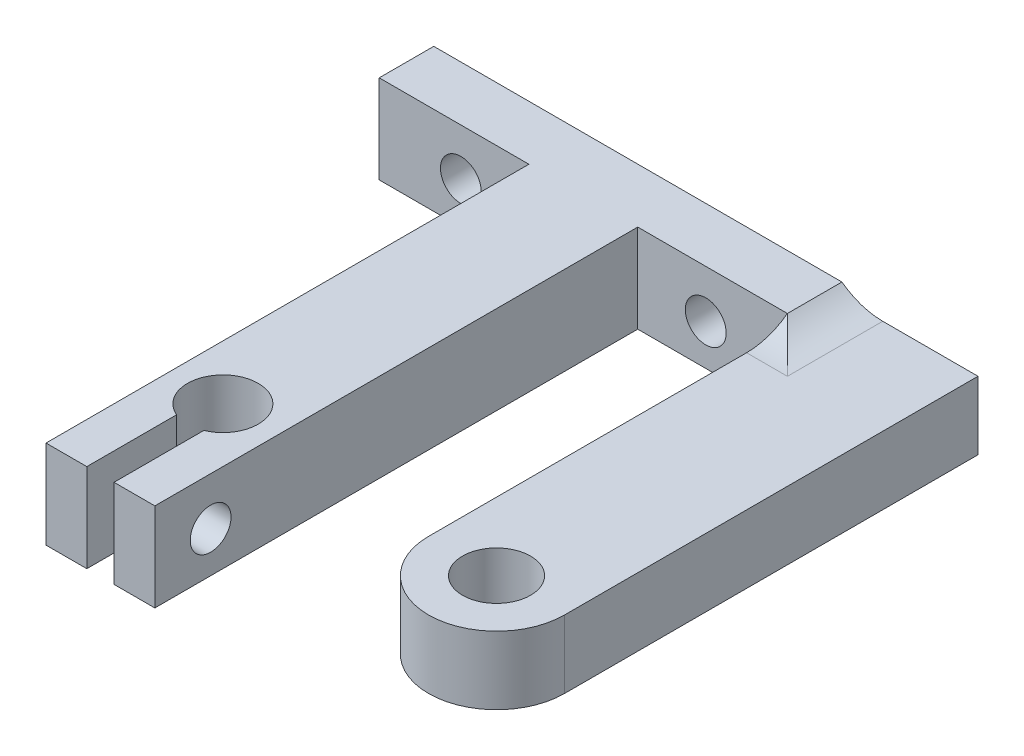
ISO-10303-21;
HEADER;
FILE_DESCRIPTION(('STEP AP214'),'2;1');
FILE_NAME('part.step','',(''),(''),'','','');
FILE_SCHEMA(('AUTOMOTIVE_DESIGN { 1 0 10303 214 1 1 1 1 }'));
ENDSEC;
DATA;
#1=APPLICATION_CONTEXT('core data for automotive mechanical design processes');
#2=APPLICATION_PROTOCOL_DEFINITION('international standard','automotive_design',2000,#1);
#3=PRODUCT_CONTEXT('',#1,'mechanical');
#4=PRODUCT('Part','Part','',(#3));
#5=PRODUCT_RELATED_PRODUCT_CATEGORY('part','',(#4));
#6=PRODUCT_DEFINITION_FORMATION('','',#4);
#7=PRODUCT_DEFINITION_CONTEXT('part definition',#1,'design');
#8=PRODUCT_DEFINITION('design','',#6,#7);
#9=PRODUCT_DEFINITION_SHAPE('','',#8);
#10=(LENGTH_UNIT() NAMED_UNIT(*) SI_UNIT(.MILLI.,.METRE.));
#11=(NAMED_UNIT(*) PLANE_ANGLE_UNIT() SI_UNIT($,.RADIAN.));
#12=(NAMED_UNIT(*) SI_UNIT($,.STERADIAN.) SOLID_ANGLE_UNIT());
#13=UNCERTAINTY_MEASURE_WITH_UNIT(LENGTH_MEASURE(1.E-05),#10,'distance_accuracy_value','');
#14=(GEOMETRIC_REPRESENTATION_CONTEXT(3) GLOBAL_UNCERTAINTY_ASSIGNED_CONTEXT((#13)) GLOBAL_UNIT_ASSIGNED_CONTEXT((#10,
#11,#12)) REPRESENTATION_CONTEXT('',''));
#15=CARTESIAN_POINT('',(0.,0.,0.));
#16=DIRECTION('',(0.,0.,1.));
#17=DIRECTION('',(1.,0.,0.));
#18=AXIS2_PLACEMENT_3D('',#15,#16,#17);
#19=CARTESIAN_POINT('',(0.,7.,28.4957983193277));
#20=DIRECTION('',(0.,-1.,0.));
#21=DIRECTION('',(0.,0.,-1.));
#22=AXIS2_PLACEMENT_3D('',#19,#20,#21);
#23=CYLINDRICAL_SURFACE('',#22,2.6);
#24=DIRECTION('',(0.,-1.,0.));
#25=VECTOR('',#24,1.);
#26=CARTESIAN_POINT('',(-1.,7.,30.8957983193277));
#27=LINE('',#26,#25);
#28=CARTESIAN_POINT('',(-1.,7.,30.8957983193277));
#29=VERTEX_POINT('',#28);
#30=CARTESIAN_POINT('',(-1.,0.499999999999998,30.8957983193277));
#31=VERTEX_POINT('',#30);
#32=EDGE_CURVE('E330',#29,#31,#27,.T.);
#33=ORIENTED_EDGE('',*,*,#32,.T.);
#34=CARTESIAN_POINT('',(0.,0.499999999999998,28.4957983193277));
#35=DIRECTION('',(0.,1.,0.));
#36=DIRECTION('',(0.,0.,1.));
#37=AXIS2_PLACEMENT_3D('',#34,#35,#36);
#38=CIRCLE('',#37,2.6);
#39=CARTESIAN_POINT('',(1.,0.499999999999998,30.8957983193277));
#40=VERTEX_POINT('',#39);
#41=EDGE_CURVE('E443',#31,#40,#38,.F.);
#42=ORIENTED_EDGE('',*,*,#41,.T.);
#43=DIRECTION('',(0.,-1.,0.));
#44=VECTOR('',#43,1.);
#45=CARTESIAN_POINT('',(1.,7.,30.8957983193277));
#46=LINE('',#45,#44);
#47=CARTESIAN_POINT('',(1.,7.,30.8957983193277));
#48=VERTEX_POINT('',#47);
#49=EDGE_CURVE('E366',#48,#40,#46,.T.);
#50=ORIENTED_EDGE('',*,*,#49,.F.);
#51=CARTESIAN_POINT('',(0.,7.,28.4957983193277));
#52=DIRECTION('',(0.,1.,0.));
#53=DIRECTION('',(0.,0.,1.));
#54=AXIS2_PLACEMENT_3D('',#51,#52,#53);
#55=CIRCLE('',#54,2.6);
#56=EDGE_CURVE('E291',#48,#29,#55,.T.);
#57=ORIENTED_EDGE('',*,*,#56,.T.);
#58=EDGE_LOOP('',(#33,#42,#50,#57));
#59=FACE_BOUND('',#58,.T.);
#60=ADVANCED_FACE('F41',(#59),#23,.F.);
#61=CARTESIAN_POINT('',(1.,7.,0.));
#62=DIRECTION('',(-1.,0.,0.));
#63=DIRECTION('',(0.,0.,1.));
#64=AXIS2_PLACEMENT_3D('',#61,#62,#63);
#65=PLANE('',#64);
#66=CARTESIAN_POINT('',(1.,3.5,33.3957983193277));
#67=DIRECTION('',(-1.,0.,0.));
#68=DIRECTION('',(0.,0.,1.));
#69=AXIS2_PLACEMENT_3D('',#66,#67,#68);
#70=CIRCLE('',#69,1.5);
#71=CARTESIAN_POINT('',(1.,3.5,34.8957983193277));
#72=VERTEX_POINT('',#71);
#73=EDGE_CURVE('E287',#72,#72,#70,.T.);
#74=ORIENTED_EDGE('',*,*,#73,.F.);
#75=EDGE_LOOP('',(#74));
#76=FACE_BOUND('',#75,.T.);
#77=ORIENTED_EDGE('',*,*,#49,.T.);
#78=DIRECTION('',(0.,0.,1.));
#79=VECTOR('',#78,1.);
#80=CARTESIAN_POINT('',(1.,0.499999999999998,37.4957983193277));
#81=LINE('',#80,#79);
#82=CARTESIAN_POINT('',(1.,0.499999999999998,37.4957983193277));
#83=VERTEX_POINT('',#82);
#84=EDGE_CURVE('E411',#40,#83,#81,.T.);
#85=ORIENTED_EDGE('',*,*,#84,.T.);
#86=DIRECTION('',(0.,-1.,0.));
#87=VECTOR('',#86,1.);
#88=CARTESIAN_POINT('',(1.,7.,37.4957983193277));
#89=LINE('',#88,#87);
#90=CARTESIAN_POINT('',(1.,7.,37.4957983193277));
#91=VERTEX_POINT('',#90);
#92=EDGE_CURVE('E362',#91,#83,#89,.T.);
#93=ORIENTED_EDGE('',*,*,#92,.F.);
#94=DIRECTION('',(0.,0.,-1.));
#95=VECTOR('',#94,1.);
#96=CARTESIAN_POINT('',(1.,7.,0.));
#97=LINE('',#96,#95);
#98=EDGE_CURVE('E295',#91,#48,#97,.T.);
#99=ORIENTED_EDGE('',*,*,#98,.T.);
#100=EDGE_LOOP('',(#77,#85,#93,#99));
#101=FACE_BOUND('',#100,.T.);
#102=ADVANCED_FACE('F550',(#76,#101),#65,.T.);
#103=CARTESIAN_POINT('',(0.,7.,37.4957983193277));
#104=DIRECTION('',(0.,0.,1.));
#105=DIRECTION('',(1.,0.,0.));
#106=AXIS2_PLACEMENT_3D('',#103,#104,#105);
#107=PLANE('',#106);
#108=ORIENTED_EDGE('',*,*,#92,.T.);
#109=DIRECTION('',(1.,0.,0.));
#110=VECTOR('',#109,1.);
#111=CARTESIAN_POINT('',(4.,0.499999999999998,37.4957983193277));
#112=LINE('',#111,#110);
#113=CARTESIAN_POINT('',(4.,0.499999999999998,37.4957983193277));
#114=VERTEX_POINT('',#113);
#115=EDGE_CURVE('E415',#83,#114,#112,.T.);
#116=ORIENTED_EDGE('',*,*,#115,.T.);
#117=DIRECTION('',(0.,-1.,0.));
#118=VECTOR('',#117,1.);
#119=CARTESIAN_POINT('',(4.,7.,37.4957983193277));
#120=LINE('',#119,#118);
#121=CARTESIAN_POINT('',(4.,7.,37.4957983193277));
#122=VERTEX_POINT('',#121);
#123=EDGE_CURVE('E358',#122,#114,#120,.T.);
#124=ORIENTED_EDGE('',*,*,#123,.F.);
#125=DIRECTION('',(-1.,0.,0.));
#126=VECTOR('',#125,1.);
#127=CARTESIAN_POINT('',(0.,7.,37.4957983193277));
#128=LINE('',#127,#126);
#129=EDGE_CURVE('E299',#122,#91,#128,.T.);
#130=ORIENTED_EDGE('',*,*,#129,.T.);
#131=EDGE_LOOP('',(#108,#116,#124,#130));
#132=FACE_BOUND('',#131,.T.);
#133=ADVANCED_FACE('F555',(#132),#107,.T.);
#134=CARTESIAN_POINT('',(4.,7.,0.));
#135=DIRECTION('',(1.,0.,0.));
#136=DIRECTION('',(0.,0.,-1.));
#137=AXIS2_PLACEMENT_3D('',#134,#135,#136);
#138=PLANE('',#137);
#139=CARTESIAN_POINT('',(4.,3.5,33.3957983193277));
#140=DIRECTION('',(1.,0.,0.));
#141=DIRECTION('',(0.,0.,-1.));
#142=AXIS2_PLACEMENT_3D('',#139,#140,#141);
#143=CIRCLE('',#142,1.5);
#144=CARTESIAN_POINT('',(4.,3.5,31.8957983193277));
#145=VERTEX_POINT('',#144);
#146=EDGE_CURVE('E278',#145,#145,#143,.T.);
#147=ORIENTED_EDGE('',*,*,#146,.F.);
#148=EDGE_LOOP('',(#147));
#149=FACE_BOUND('',#148,.T.);
#150=ORIENTED_EDGE('',*,*,#123,.T.);
#151=DIRECTION('',(0.,0.,-1.));
#152=VECTOR('',#151,1.);
#153=CARTESIAN_POINT('',(4.,0.499999999999998,2.00420168067227));
#154=LINE('',#153,#152);
#155=CARTESIAN_POINT('',(4.,0.499999999999998,2.00420168067227));
#156=VERTEX_POINT('',#155);
#157=EDGE_CURVE('E418',#114,#156,#154,.T.);
#158=ORIENTED_EDGE('',*,*,#157,.T.);
#159=DIRECTION('',(0.,-1.,0.));
#160=VECTOR('',#159,1.);
#161=CARTESIAN_POINT('',(4.,7.,2.00420168067227));
#162=LINE('',#161,#160);
#163=CARTESIAN_POINT('',(4.,7.,2.00420168067227));
#164=VERTEX_POINT('',#163);
#165=EDGE_CURVE('E354',#164,#156,#162,.T.);
#166=ORIENTED_EDGE('',*,*,#165,.F.);
#167=DIRECTION('',(0.,0.,1.));
#168=VECTOR('',#167,1.);
#169=CARTESIAN_POINT('',(4.,7.,0.));
#170=LINE('',#169,#168);
#171=EDGE_CURVE('E303',#164,#122,#170,.T.);
#172=ORIENTED_EDGE('',*,*,#171,.T.);
#173=EDGE_LOOP('',(#150,#158,#166,#172));
#174=FACE_BOUND('',#173,.T.);
#175=ADVANCED_FACE('F559',(#149,#174),#138,.T.);
#176=CARTESIAN_POINT('',(0.,7.,2.00420168067227));
#177=DIRECTION('',(0.,0.,-1.));
#178=DIRECTION('',(-1.,0.,0.));
#179=AXIS2_PLACEMENT_3D('',#176,#177,#178);
#180=PLANE('',#179);
#181=CARTESIAN_POINT('',(9.,3.5,2.00420168067227));
#182=DIRECTION('',(0.,0.,1.));
#183=DIRECTION('',(1.,0.,0.));
#184=AXIS2_PLACEMENT_3D('',#181,#182,#183);
#185=CIRCLE('',#184,1.5);
#186=CARTESIAN_POINT('',(10.5,3.5,2.00420168067227));
#187=VERTEX_POINT('',#186);
#188=EDGE_CURVE('E264',#187,#187,#185,.T.);
#189=ORIENTED_EDGE('',*,*,#188,.F.);
#190=EDGE_LOOP('',(#189));
#191=FACE_BOUND('',#190,.T.);
#192=DIRECTION('',(0.,-1.,0.));
#193=VECTOR('',#192,1.);
#194=CARTESIAN_POINT('',(15.,7.,2.00420168067227));
#195=LINE('',#194,#193);
#196=CARTESIAN_POINT('',(15.,7.,2.00420168067227));
#197=VERTEX_POINT('',#196);
#198=CARTESIAN_POINT('',(15.,1.,2.00420168067227));
#199=VERTEX_POINT('',#198);
#200=EDGE_CURVE('E257',#197,#199,#195,.T.);
#201=ORIENTED_EDGE('',*,*,#200,.F.);
#202=DIRECTION('',(1.,0.,0.));
#203=VECTOR('',#202,1.);
#204=CARTESIAN_POINT('',(0.,7.,2.00420168067227));
#205=LINE('',#204,#203);
#206=EDGE_CURVE('E308',#164,#197,#205,.T.);
#207=ORIENTED_EDGE('',*,*,#206,.F.);
#208=ORIENTED_EDGE('',*,*,#165,.T.);
#209=DIRECTION('',(1.,0.,0.));
#210=VECTOR('',#209,1.);
#211=CARTESIAN_POINT('',(0.,0.499999999999998,2.00420168067227));
#212=LINE('',#211,#210);
#213=CARTESIAN_POINT('',(14.7023723262089,0.499999999999998,2.00420168067227));
#214=VERTEX_POINT('',#213);
#215=EDGE_CURVE('E421',#156,#214,#212,.T.);
#216=ORIENTED_EDGE('',*,*,#215,.T.);
#217=CARTESIAN_POINT('',(10.5620339643028,3.30314078293055,2.00420168067227));
#218=DIRECTION('',(0.,0.,-1.));
#219=DIRECTION('',(-1.,0.,0.));
#220=AXIS2_PLACEMENT_3D('',#217,#218,#219);
#221=CIRCLE('',#220,5.);
#222=EDGE_CURVE('E520',#214,#199,#221,.F.);
#223=ORIENTED_EDGE('',*,*,#222,.T.);
#224=EDGE_LOOP('',(#201,#207,#208,#216,#223));
#225=FACE_BOUND('',#224,.T.);
#226=ADVANCED_FACE('F562',(#191,#225),#180,.F.);
#227=CARTESIAN_POINT('',(0.,7.,-2.00420168067227));
#228=DIRECTION('',(0.,0.,-1.));
#229=DIRECTION('',(-1.,0.,0.));
#230=AXIS2_PLACEMENT_3D('',#227,#228,#229);
#231=PLANE('',#230);
#232=CARTESIAN_POINT('',(9.,3.5,-2.00420168067227));
#233=DIRECTION('',(0.,0.,-1.));
#234=DIRECTION('',(-1.,0.,0.));
#235=AXIS2_PLACEMENT_3D('',#232,#233,#234);
#236=CIRCLE('',#235,1.5);
#237=CARTESIAN_POINT('',(7.5,3.5,-2.00420168067227));
#238=VERTEX_POINT('',#237);
#239=EDGE_CURVE('E277',#238,#238,#236,.T.);
#240=ORIENTED_EDGE('',*,*,#239,.F.);
#241=EDGE_LOOP('',(#240));
#242=FACE_BOUND('',#241,.T.);
#243=CARTESIAN_POINT('',(-9.,3.5,-2.00420168067227));
#244=DIRECTION('',(0.,0.,-1.));
#245=DIRECTION('',(-1.,0.,0.));
#246=AXIS2_PLACEMENT_3D('',#243,#244,#245);
#247=CIRCLE('',#246,1.5);
#248=CARTESIAN_POINT('',(-10.5,3.5,-2.00420168067227));
#249=VERTEX_POINT('',#248);
#250=EDGE_CURVE('E268',#249,#249,#247,.T.);
#251=ORIENTED_EDGE('',*,*,#250,.F.);
#252=EDGE_LOOP('',(#251));
#253=FACE_BOUND('',#252,.T.);
#254=DIRECTION('',(1.,0.,0.));
#255=VECTOR('',#254,1.);
#256=CARTESIAN_POINT('',(0.,1.,-2.00420168067227));
#257=LINE('',#256,#255);
#258=CARTESIAN_POINT('',(15.,1.,-2.00420168067227));
#259=VERTEX_POINT('',#258);
#260=CARTESIAN_POINT('',(25.,1.,-2.00420168067227));
#261=VERTEX_POINT('',#260);
#262=EDGE_CURVE('E247',#259,#261,#257,.T.);
#263=ORIENTED_EDGE('',*,*,#262,.F.);
#264=CARTESIAN_POINT('',(10.5620339643028,3.30314078293055,-2.00420168067227));
#265=DIRECTION('',(0.,0.,-1.));
#266=DIRECTION('',(-1.,0.,0.));
#267=AXIS2_PLACEMENT_3D('',#264,#265,#266);
#268=CIRCLE('',#267,5.);
#269=CARTESIAN_POINT('',(14.7023723262089,0.499999999999998,-2.00420168067227));
#270=VERTEX_POINT('',#269);
#271=EDGE_CURVE('E446',#259,#270,#268,.T.);
#272=ORIENTED_EDGE('',*,*,#271,.T.);
#273=DIRECTION('',(-1.,0.,0.));
#274=VECTOR('',#273,1.);
#275=CARTESIAN_POINT('',(-15.,0.499999999999998,-2.00420168067227));
#276=LINE('',#275,#274);
#277=CARTESIAN_POINT('',(-15.,0.499999999999998,-2.00420168067227));
#278=VERTEX_POINT('',#277);
#279=EDGE_CURVE('E425',#270,#278,#276,.T.);
#280=ORIENTED_EDGE('',*,*,#279,.T.);
#281=DIRECTION('',(0.,-1.,0.));
#282=VECTOR('',#281,1.);
#283=CARTESIAN_POINT('',(-15.,7.,-2.00420168067227));
#284=LINE('',#283,#282);
#285=CARTESIAN_POINT('',(-15.,7.,-2.00420168067227));
#286=VERTEX_POINT('',#285);
#287=EDGE_CURVE('E350',#286,#278,#284,.T.);
#288=ORIENTED_EDGE('',*,*,#287,.F.);
#289=DIRECTION('',(1.,0.,0.));
#290=VECTOR('',#289,1.);
#291=CARTESIAN_POINT('',(0.,7.,-2.00420168067227));
#292=LINE('',#291,#290);
#293=CARTESIAN_POINT('',(15.,7.,-2.00420168067227));
#294=VERTEX_POINT('',#293);
#295=EDGE_CURVE('E317',#286,#294,#292,.T.);
#296=ORIENTED_EDGE('',*,*,#295,.T.);
#297=CARTESIAN_POINT('',(18.,11.,-2.00420168067227));
#298=DIRECTION('',(0.,0.,-1.));
#299=DIRECTION('',(-1.,0.,0.));
#300=AXIS2_PLACEMENT_3D('',#297,#298,#299);
#301=CIRCLE('',#300,5.);
#302=CARTESIAN_POINT('',(18.,6.,-2.00420168067227));
#303=VERTEX_POINT('',#302);
#304=EDGE_CURVE('E525',#294,#303,#301,.F.);
#305=ORIENTED_EDGE('',*,*,#304,.T.);
#306=DIRECTION('',(1.,0.,0.));
#307=VECTOR('',#306,1.);
#308=CARTESIAN_POINT('',(0.,6.,-2.00420168067227));
#309=LINE('',#308,#307);
#310=CARTESIAN_POINT('',(25.,6.,-2.00420168067227));
#311=VERTEX_POINT('',#310);
#312=EDGE_CURVE('E222',#303,#311,#309,.T.);
#313=ORIENTED_EDGE('',*,*,#312,.T.);
#314=DIRECTION('',(0.,1.,0.));
#315=VECTOR('',#314,1.);
#316=CARTESIAN_POINT('',(25.,1.,-2.00420168067227));
#317=LINE('',#316,#315);
#318=EDGE_CURVE('E213',#261,#311,#317,.T.);
#319=ORIENTED_EDGE('',*,*,#318,.F.);
#320=EDGE_LOOP('',(#263,#272,#280,#288,#296,#305,#313,#319));
#321=FACE_BOUND('',#320,.T.);
#322=ADVANCED_FACE('F564',(#242,#253,#321),#231,.T.);
#323=CARTESIAN_POINT('',(-15.,7.,0.));
#324=DIRECTION('',(1.,0.,0.));
#325=DIRECTION('',(0.,0.,-1.));
#326=AXIS2_PLACEMENT_3D('',#323,#324,#325);
#327=PLANE('',#326);
#328=ORIENTED_EDGE('',*,*,#287,.T.);
#329=DIRECTION('',(0.,0.,1.));
#330=VECTOR('',#329,1.);
#331=CARTESIAN_POINT('',(-15.,0.499999999999998,0.));
#332=LINE('',#331,#330);
#333=CARTESIAN_POINT('',(-15.,0.499999999999998,2.00420168067227));
#334=VERTEX_POINT('',#333);
#335=EDGE_CURVE('E428',#278,#334,#332,.T.);
#336=ORIENTED_EDGE('',*,*,#335,.T.);
#337=DIRECTION('',(0.,-1.,0.));
#338=VECTOR('',#337,1.);
#339=CARTESIAN_POINT('',(-15.,7.,2.00420168067227));
#340=LINE('',#339,#338);
#341=CARTESIAN_POINT('',(-15.,7.,2.00420168067227));
#342=VERTEX_POINT('',#341);
#343=EDGE_CURVE('E346',#342,#334,#340,.T.);
#344=ORIENTED_EDGE('',*,*,#343,.F.);
#345=DIRECTION('',(0.,0.,1.));
#346=VECTOR('',#345,1.);
#347=CARTESIAN_POINT('',(-15.,7.,0.));
#348=LINE('',#347,#346);
#349=EDGE_CURVE('E321',#286,#342,#348,.T.);
#350=ORIENTED_EDGE('',*,*,#349,.F.);
#351=EDGE_LOOP('',(#328,#336,#344,#350));
#352=FACE_BOUND('',#351,.T.);
#353=ADVANCED_FACE('F567',(#352),#327,.F.);
#354=CARTESIAN_POINT('',(-9.,3.5,2.00420168067227));
#355=DIRECTION('',(0.,0.,1.));
#356=DIRECTION('',(-1.,0.,0.));
#357=AXIS2_PLACEMENT_3D('',#354,#355,#356);
#358=CIRCLE('',#357,1.5);
#359=CARTESIAN_POINT('',(-10.5,3.5,2.00420168067227));
#360=VERTEX_POINT('',#359);
#361=EDGE_CURVE('E269',#360,#360,#358,.T.);
#362=ORIENTED_EDGE('',*,*,#361,.F.);
#363=EDGE_LOOP('',(#362));
#364=FACE_BOUND('',#363,.T.);
#365=ORIENTED_EDGE('',*,*,#343,.T.);
#366=DIRECTION('',(1.,0.,0.));
#367=VECTOR('',#366,1.);
#368=CARTESIAN_POINT('',(0.,0.499999999999998,2.00420168067227));
#369=LINE('',#368,#367);
#370=CARTESIAN_POINT('',(-4.,0.499999999999998,2.00420168067227));
#371=VERTEX_POINT('',#370);
#372=EDGE_CURVE('E431',#334,#371,#369,.T.);
#373=ORIENTED_EDGE('',*,*,#372,.T.);
#374=DIRECTION('',(0.,-1.,0.));
#375=VECTOR('',#374,1.);
#376=CARTESIAN_POINT('',(-4.,7.,2.00420168067227));
#377=LINE('',#376,#375);
#378=CARTESIAN_POINT('',(-4.,7.,2.00420168067227));
#379=VERTEX_POINT('',#378);
#380=EDGE_CURVE('E342',#379,#371,#377,.T.);
#381=ORIENTED_EDGE('',*,*,#380,.F.);
#382=EDGE_CURVE('E313',#342,#379,#205,.T.);
#383=ORIENTED_EDGE('',*,*,#382,.F.);
#384=EDGE_LOOP('',(#365,#373,#381,#383));
#385=FACE_BOUND('',#384,.T.);
#386=ADVANCED_FACE('F571',(#364,#385),#180,.F.);
#387=CARTESIAN_POINT('',(-4.,7.,0.));
#388=DIRECTION('',(1.,0.,0.));
#389=DIRECTION('',(0.,0.,-1.));
#390=AXIS2_PLACEMENT_3D('',#387,#388,#389);
#391=PLANE('',#390);
#392=CARTESIAN_POINT('',(-4.,3.5,33.3957983193277));
#393=DIRECTION('',(1.,0.,0.));
#394=DIRECTION('',(0.,0.,-1.));
#395=AXIS2_PLACEMENT_3D('',#392,#393,#394);
#396=CIRCLE('',#395,1.5);
#397=CARTESIAN_POINT('',(-4.,3.5,31.8957983193277));
#398=VERTEX_POINT('',#397);
#399=EDGE_CURVE('E283',#398,#398,#396,.T.);
#400=ORIENTED_EDGE('',*,*,#399,.T.);
#401=EDGE_LOOP('',(#400));
#402=FACE_BOUND('',#401,.T.);
#403=ORIENTED_EDGE('',*,*,#380,.T.);
#404=DIRECTION('',(0.,0.,1.));
#405=VECTOR('',#404,1.);
#406=CARTESIAN_POINT('',(-4.,0.499999999999998,0.));
#407=LINE('',#406,#405);
#408=CARTESIAN_POINT('',(-4.,0.499999999999998,37.4957983193277));
#409=VERTEX_POINT('',#408);
#410=EDGE_CURVE('E434',#371,#409,#407,.T.);
#411=ORIENTED_EDGE('',*,*,#410,.T.);
#412=DIRECTION('',(0.,-1.,0.));
#413=VECTOR('',#412,1.);
#414=CARTESIAN_POINT('',(-4.,7.,37.4957983193277));
#415=LINE('',#414,#413);
#416=CARTESIAN_POINT('',(-4.,7.,37.4957983193277));
#417=VERTEX_POINT('',#416);
#418=EDGE_CURVE('E338',#417,#409,#415,.T.);
#419=ORIENTED_EDGE('',*,*,#418,.F.);
#420=DIRECTION('',(0.,0.,1.));
#421=VECTOR('',#420,1.);
#422=CARTESIAN_POINT('',(-4.,7.,0.));
#423=LINE('',#422,#421);
#424=EDGE_CURVE('E324',#379,#417,#423,.T.);
#425=ORIENTED_EDGE('',*,*,#424,.F.);
#426=EDGE_LOOP('',(#403,#411,#419,#425));
#427=FACE_BOUND('',#426,.T.);
#428=ADVANCED_FACE('F575',(#402,#427),#391,.F.);
#429=ORIENTED_EDGE('',*,*,#418,.T.);
#430=DIRECTION('',(1.,0.,0.));
#431=VECTOR('',#430,1.);
#432=CARTESIAN_POINT('',(-1.,0.499999999999998,37.4957983193277));
#433=LINE('',#432,#431);
#434=CARTESIAN_POINT('',(-1.,0.499999999999998,37.4957983193277));
#435=VERTEX_POINT('',#434);
#436=EDGE_CURVE('E437',#409,#435,#433,.T.);
#437=ORIENTED_EDGE('',*,*,#436,.T.);
#438=DIRECTION('',(0.,-1.,0.));
#439=VECTOR('',#438,1.);
#440=CARTESIAN_POINT('',(-1.,7.,37.4957983193277));
#441=LINE('',#440,#439);
#442=CARTESIAN_POINT('',(-1.,7.,37.4957983193277));
#443=VERTEX_POINT('',#442);
#444=EDGE_CURVE('E334',#443,#435,#441,.T.);
#445=ORIENTED_EDGE('',*,*,#444,.F.);
#446=EDGE_CURVE('E304',#443,#417,#128,.T.);
#447=ORIENTED_EDGE('',*,*,#446,.T.);
#448=EDGE_LOOP('',(#429,#437,#445,#447));
#449=FACE_BOUND('',#448,.T.);
#450=ADVANCED_FACE('F579',(#449),#107,.T.);
#451=CARTESIAN_POINT('',(-1.,7.,0.));
#452=DIRECTION('',(-1.,0.,0.));
#453=DIRECTION('',(0.,0.,1.));
#454=AXIS2_PLACEMENT_3D('',#451,#452,#453);
#455=PLANE('',#454);
#456=CARTESIAN_POINT('',(-1.,3.5,33.3957983193277));
#457=DIRECTION('',(-1.,0.,0.));
#458=DIRECTION('',(0.,0.,1.));
#459=AXIS2_PLACEMENT_3D('',#456,#457,#458);
#460=CIRCLE('',#459,1.5);
#461=CARTESIAN_POINT('',(-1.,3.5,34.8957983193277));
#462=VERTEX_POINT('',#461);
#463=EDGE_CURVE('E282',#462,#462,#460,.T.);
#464=ORIENTED_EDGE('',*,*,#463,.T.);
#465=EDGE_LOOP('',(#464));
#466=FACE_BOUND('',#465,.T.);
#467=ORIENTED_EDGE('',*,*,#444,.T.);
#468=DIRECTION('',(0.,0.,-1.));
#469=VECTOR('',#468,1.);
#470=CARTESIAN_POINT('',(-1.,0.499999999999998,0.));
#471=LINE('',#470,#469);
#472=EDGE_CURVE('E440',#435,#31,#471,.T.);
#473=ORIENTED_EDGE('',*,*,#472,.T.);
#474=ORIENTED_EDGE('',*,*,#32,.F.);
#475=DIRECTION('',(0.,0.,-1.));
#476=VECTOR('',#475,1.);
#477=CARTESIAN_POINT('',(-1.,7.,0.));
#478=LINE('',#477,#476);
#479=EDGE_CURVE('E327',#443,#29,#478,.T.);
#480=ORIENTED_EDGE('',*,*,#479,.F.);
#481=EDGE_LOOP('',(#467,#473,#474,#480));
#482=FACE_BOUND('',#481,.T.);
#483=ADVANCED_FACE('F583',(#466,#482),#455,.F.);
#484=CARTESIAN_POINT('',(0.,7.,0.));
#485=DIRECTION('',(0.,1.,0.));
#486=DIRECTION('',(0.,0.,1.));
#487=AXIS2_PLACEMENT_3D('',#484,#485,#486);
#488=PLANE('',#487);
#489=ORIENTED_EDGE('',*,*,#56,.F.);
#490=ORIENTED_EDGE('',*,*,#98,.F.);
#491=ORIENTED_EDGE('',*,*,#129,.F.);
#492=ORIENTED_EDGE('',*,*,#171,.F.);
#493=ORIENTED_EDGE('',*,*,#206,.T.);
#494=DIRECTION('',(0.,0.,1.));
#495=VECTOR('',#494,1.);
#496=CARTESIAN_POINT('',(15.,7.,0.));
#497=LINE('',#496,#495);
#498=EDGE_CURVE('E312',#294,#197,#497,.T.);
#499=ORIENTED_EDGE('',*,*,#498,.F.);
#500=ORIENTED_EDGE('',*,*,#295,.F.);
#501=ORIENTED_EDGE('',*,*,#349,.T.);
#502=ORIENTED_EDGE('',*,*,#382,.T.);
#503=ORIENTED_EDGE('',*,*,#424,.T.);
#504=ORIENTED_EDGE('',*,*,#446,.F.);
#505=ORIENTED_EDGE('',*,*,#479,.T.);
#506=EDGE_LOOP('',(#489,#490,#491,#492,#493,#499,#500,#501,#502,#503,#504,#505));
#507=FACE_BOUND('',#506,.T.);
#508=ADVANCED_FACE('F538',(#507),#488,.T.);
#509=CARTESIAN_POINT('',(0.,0.,0.));
#510=DIRECTION('',(0.,1.,0.));
#511=DIRECTION('',(0.,0.,1.));
#512=AXIS2_PLACEMENT_3D('',#509,#510,#511);
#513=PLANE('',#512);
#514=DIRECTION('',(1.,0.,0.));
#515=VECTOR('',#514,1.);
#516=CARTESIAN_POINT('',(15.,0.,-1.40832488437518));
#517=LINE('',#516,#515);
#518=CARTESIAN_POINT('',(-14.4041232037029,0.,-1.40832488437518));
#519=VERTEX_POINT('',#518);
#520=CARTESIAN_POINT('',(14.3156003974622,0.,-1.40832488437518));
#521=VERTEX_POINT('',#520);
#522=EDGE_CURVE('E394',#519,#521,#517,.T.);
#523=ORIENTED_EDGE('',*,*,#522,.T.);
#524=DIRECTION('',(0.,0.,1.));
#525=VECTOR('',#524,1.);
#526=CARTESIAN_POINT('',(14.3156003974622,0.,0.));
#527=LINE('',#526,#525);
#528=CARTESIAN_POINT('',(14.3156003974622,0.,1.40832488437518));
#529=VERTEX_POINT('',#528);
#530=EDGE_CURVE('E514',#521,#529,#527,.T.);
#531=ORIENTED_EDGE('',*,*,#530,.T.);
#532=DIRECTION('',(-1.,0.,0.));
#533=VECTOR('',#532,1.);
#534=CARTESIAN_POINT('',(0.,0.,1.40832488437518));
#535=LINE('',#534,#533);
#536=CARTESIAN_POINT('',(3.40412320370291,0.,1.40832488437518));
#537=VERTEX_POINT('',#536);
#538=EDGE_CURVE('E398',#529,#537,#535,.T.);
#539=ORIENTED_EDGE('',*,*,#538,.T.);
#540=DIRECTION('',(0.,0.,1.));
#541=VECTOR('',#540,1.);
#542=CARTESIAN_POINT('',(3.4041232037029,0.,37.4957983193277));
#543=LINE('',#542,#541);
#544=CARTESIAN_POINT('',(3.4041232037029,0.,36.8999215230306));
#545=VERTEX_POINT('',#544);
#546=EDGE_CURVE('E401',#537,#545,#543,.T.);
#547=ORIENTED_EDGE('',*,*,#546,.T.);
#548=DIRECTION('',(-1.,0.,0.));
#549=VECTOR('',#548,1.);
#550=CARTESIAN_POINT('',(1.,0.,36.8999215230306));
#551=LINE('',#550,#549);
#552=CARTESIAN_POINT('',(1.5958767962971,0.,36.8999215230306));
#553=VERTEX_POINT('',#552);
#554=EDGE_CURVE('E404',#545,#553,#551,.T.);
#555=ORIENTED_EDGE('',*,*,#554,.T.);
#556=DIRECTION('',(0.,0.,-1.));
#557=VECTOR('',#556,1.);
#558=CARTESIAN_POINT('',(1.5958767962971,0.,30.8957983193277));
#559=LINE('',#558,#557);
#560=CARTESIAN_POINT('',(1.5958767962971,0.,31.2646980553512));
#561=VERTEX_POINT('',#560);
#562=EDGE_CURVE('E407',#553,#561,#559,.T.);
#563=ORIENTED_EDGE('',*,*,#562,.T.);
#564=CARTESIAN_POINT('',(0.,0.,28.4957983193277));
#565=DIRECTION('',(0.,1.,0.));
#566=DIRECTION('',(0.,0.,1.));
#567=AXIS2_PLACEMENT_3D('',#564,#565,#566);
#568=CIRCLE('',#567,3.1958767962971);
#569=CARTESIAN_POINT('',(-1.5958767962971,0.,31.2646980553512));
#570=VERTEX_POINT('',#569);
#571=EDGE_CURVE('E370',#561,#570,#568,.T.);
#572=ORIENTED_EDGE('',*,*,#571,.T.);
#573=DIRECTION('',(0.,0.,1.));
#574=VECTOR('',#573,1.);
#575=CARTESIAN_POINT('',(-1.5958767962971,0.,0.));
#576=LINE('',#575,#574);
#577=CARTESIAN_POINT('',(-1.5958767962971,0.,36.8999215230306));
#578=VERTEX_POINT('',#577);
#579=EDGE_CURVE('E379',#570,#578,#576,.T.);
#580=ORIENTED_EDGE('',*,*,#579,.T.);
#581=DIRECTION('',(-1.,0.,0.));
#582=VECTOR('',#581,1.);
#583=CARTESIAN_POINT('',(-4.,0.,36.8999215230306));
#584=LINE('',#583,#582);
#585=CARTESIAN_POINT('',(-3.4041232037029,0.,36.8999215230306));
#586=VERTEX_POINT('',#585);
#587=EDGE_CURVE('E382',#578,#586,#584,.T.);
#588=ORIENTED_EDGE('',*,*,#587,.T.);
#589=DIRECTION('',(0.,0.,-1.));
#590=VECTOR('',#589,1.);
#591=CARTESIAN_POINT('',(-3.40412320370291,0.,0.));
#592=LINE('',#591,#590);
#593=CARTESIAN_POINT('',(-3.40412320370291,0.,1.40832488437518));
#594=VERTEX_POINT('',#593);
#595=EDGE_CURVE('E385',#586,#594,#592,.T.);
#596=ORIENTED_EDGE('',*,*,#595,.T.);
#597=DIRECTION('',(-1.,0.,0.));
#598=VECTOR('',#597,1.);
#599=CARTESIAN_POINT('',(0.,0.,1.40832488437518));
#600=LINE('',#599,#598);
#601=CARTESIAN_POINT('',(-14.4041232037029,0.,1.40832488437518));
#602=VERTEX_POINT('',#601);
#603=EDGE_CURVE('E388',#594,#602,#600,.T.);
#604=ORIENTED_EDGE('',*,*,#603,.T.);
#605=DIRECTION('',(0.,0.,-1.));
#606=VECTOR('',#605,1.);
#607=CARTESIAN_POINT('',(-14.4041232037029,0.,0.));
#608=LINE('',#607,#606);
#609=EDGE_CURVE('E391',#602,#519,#608,.T.);
#610=ORIENTED_EDGE('',*,*,#609,.T.);
#611=EDGE_LOOP('',(#523,#531,#539,#547,#555,#563,#572,#580,#588,#596,#604,#610));
#612=FACE_BOUND('',#611,.T.);
#613=ADVANCED_FACE('F588',(#612),#513,.F.);
#614=CARTESIAN_POINT('',(-15.,3.5,33.3957983193277));
#615=DIRECTION('',(1.,0.,0.));
#616=DIRECTION('',(0.,0.,-1.));
#617=AXIS2_PLACEMENT_3D('',#614,#615,#616);
#618=CYLINDRICAL_SURFACE('',#617,1.5);
#619=ORIENTED_EDGE('',*,*,#463,.F.);
#620=EDGE_LOOP('',(#619));
#621=FACE_BOUND('',#620,.T.);
#622=ORIENTED_EDGE('',*,*,#399,.F.);
#623=EDGE_LOOP('',(#622));
#624=FACE_BOUND('',#623,.T.);
#625=ADVANCED_FACE('F591',(#621,#624),#618,.F.);
#626=ORIENTED_EDGE('',*,*,#73,.T.);
#627=EDGE_LOOP('',(#626));
#628=FACE_BOUND('',#627,.T.);
#629=ORIENTED_EDGE('',*,*,#146,.T.);
#630=EDGE_LOOP('',(#629));
#631=FACE_BOUND('',#630,.T.);
#632=ADVANCED_FACE('F595',(#628,#631),#618,.F.);
#633=CARTESIAN_POINT('',(-9.,3.5,-2.99579831932773));
#634=DIRECTION('',(0.,0.,1.));
#635=DIRECTION('',(1.,0.,0.));
#636=AXIS2_PLACEMENT_3D('',#633,#634,#635);
#637=CYLINDRICAL_SURFACE('',#636,1.5);
#638=ORIENTED_EDGE('',*,*,#250,.T.);
#639=EDGE_LOOP('',(#638));
#640=FACE_BOUND('',#639,.T.);
#641=ORIENTED_EDGE('',*,*,#361,.T.);
#642=EDGE_LOOP('',(#641));
#643=FACE_BOUND('',#642,.T.);
#644=ADVANCED_FACE('F598',(#640,#643),#637,.F.);
#645=CARTESIAN_POINT('',(9.,3.5,-2.99579831932773));
#646=DIRECTION('',(0.,0.,1.));
#647=DIRECTION('',(1.,0.,0.));
#648=AXIS2_PLACEMENT_3D('',#645,#646,#647);
#649=CYLINDRICAL_SURFACE('',#648,1.5);
#650=ORIENTED_EDGE('',*,*,#239,.T.);
#651=EDGE_LOOP('',(#650));
#652=FACE_BOUND('',#651,.T.);
#653=ORIENTED_EDGE('',*,*,#188,.T.);
#654=EDGE_LOOP('',(#653));
#655=FACE_BOUND('',#654,.T.);
#656=ADVANCED_FACE('F602',(#652,#655),#649,.F.);
#657=CARTESIAN_POINT('',(-15.,0.499999999999998,0.));
#658=DIRECTION('',(0.642787609686543,0.766044443118975,0.));
#659=DIRECTION('',(0.,0.,1.));
#660=AXIS2_PLACEMENT_3D('',#657,#658,#659);
#661=PLANE('',#660);
#662=DIRECTION('',(0.608120402411342,-0.510273605374741,-0.608120402411341));
#663=VECTOR('',#662,1.);
#664=CARTESIAN_POINT('',(-9.45284364256602,-4.1546168536056,-3.5429546767617));
#665=LINE('',#664,#663);
#666=EDGE_CURVE('E502',#334,#602,#665,.T.);
#667=ORIENTED_EDGE('',*,*,#666,.F.);
#668=ORIENTED_EDGE('',*,*,#335,.F.);
#669=DIRECTION('',(-0.608120402411341,0.510273605374741,-0.608120402411341));
#670=VECTOR('',#669,1.);
#671=CARTESIAN_POINT('',(-14.2588253270319,-0.121919394725456,-1.26302700770421));
#672=LINE('',#671,#670);
#673=EDGE_CURVE('E273',#519,#278,#672,.T.);
#674=ORIENTED_EDGE('',*,*,#673,.F.);
#675=ORIENTED_EDGE('',*,*,#609,.F.);
#676=EDGE_LOOP('',(#667,#668,#674,#675));
#677=FACE_BOUND('',#676,.T.);
#678=ADVANCED_FACE('F606',(#677),#661,.F.);
#679=CARTESIAN_POINT('',(0.,0.,-1.40832488437518));
#680=DIRECTION('',(0.,-0.766044443118975,-0.642787609686543));
#681=DIRECTION('',(-1.,0.,0.));
#682=AXIS2_PLACEMENT_3D('',#679,#680,#681);
#683=PLANE('',#682);
#684=ORIENTED_EDGE('',*,*,#279,.F.);
#685=CARTESIAN_POINT('',(10.5620339643028,3.30314078293055,-5.34485477927707));
#686=DIRECTION('',(0.,-0.766044443118975,-0.642787609686543));
#687=DIRECTION('',(0.,-0.642787609686543,0.766044443118975));
#688=AXIS2_PLACEMENT_3D('',#685,#686,#687);
#689=ELLIPSE('',#688,7.77861913430202,5.);
#690=EDGE_CURVE('E511',#270,#521,#689,.T.);
#691=ORIENTED_EDGE('',*,*,#690,.T.);
#692=ORIENTED_EDGE('',*,*,#522,.F.);
#693=ORIENTED_EDGE('',*,*,#673,.T.);
#694=EDGE_LOOP('',(#684,#691,#692,#693));
#695=FACE_BOUND('',#694,.T.);
#696=ADVANCED_FACE('F637',(#695),#683,.T.);
#697=CARTESIAN_POINT('',(0.,0.499999999999998,2.00420168067227));
#698=DIRECTION('',(0.,0.766044443118975,-0.642787609686543));
#699=DIRECTION('',(1.,0.,0.));
#700=AXIS2_PLACEMENT_3D('',#697,#698,#699);
#701=PLANE('',#700);
#702=ORIENTED_EDGE('',*,*,#666,.T.);
#703=ORIENTED_EDGE('',*,*,#603,.F.);
#704=DIRECTION('',(0.608120402411341,-0.510273605374741,-0.608120402411341));
#705=VECTOR('',#704,1.);
#706=CARTESIAN_POINT('',(-2.52075830468427,-0.741231160961496,0.524959985356548));
#707=LINE('',#706,#705);
#708=EDGE_CURVE('E498',#371,#594,#707,.T.);
#709=ORIENTED_EDGE('',*,*,#708,.F.);
#710=ORIENTED_EDGE('',*,*,#372,.F.);
#711=EDGE_LOOP('',(#702,#703,#709,#710));
#712=FACE_BOUND('',#711,.T.);
#713=ADVANCED_FACE('F641',(#712),#701,.F.);
#714=CARTESIAN_POINT('',(-4.,0.499999999999998,0.));
#715=DIRECTION('',(0.642787609686543,0.766044443118975,0.));
#716=DIRECTION('',(0.,0.,1.));
#717=AXIS2_PLACEMENT_3D('',#714,#715,#716);
#718=PLANE('',#717);
#719=ORIENTED_EDGE('',*,*,#708,.T.);
#720=ORIENTED_EDGE('',*,*,#595,.F.);
#721=DIRECTION('',(-0.60812040241134,0.51027360537474,0.608120402411343));
#722=VECTOR('',#721,1.);
#723=CARTESIAN_POINT('',(-2.14524295897564,-1.05632594904702,35.6410412783033));
#724=LINE('',#723,#722);
#725=EDGE_CURVE('E494',#409,#586,#724,.F.);
#726=ORIENTED_EDGE('',*,*,#725,.F.);
#727=ORIENTED_EDGE('',*,*,#410,.F.);
#728=EDGE_LOOP('',(#719,#720,#726,#727));
#729=FACE_BOUND('',#728,.T.);
#730=ADVANCED_FACE('F645',(#729),#718,.F.);
#731=CARTESIAN_POINT('',(0.,0.499999999999998,2.00420168067227));
#732=DIRECTION('',(0.,0.766044443118975,-0.642787609686543));
#733=DIRECTION('',(1.,0.,0.));
#734=AXIS2_PLACEMENT_3D('',#731,#732,#733);
#735=PLANE('',#734);
#736=ORIENTED_EDGE('',*,*,#538,.F.);
#737=CARTESIAN_POINT('',(10.5620339643028,3.30314078293055,5.34485477927707));
#738=DIRECTION('',(0.,0.766044443118975,-0.642787609686543));
#739=DIRECTION('',(0.,0.642787609686543,0.766044443118975));
#740=AXIS2_PLACEMENT_3D('',#737,#738,#739);
#741=ELLIPSE('',#740,7.77861913430202,5.);
#742=EDGE_CURVE('E517',#529,#214,#741,.F.);
#743=ORIENTED_EDGE('',*,*,#742,.T.);
#744=ORIENTED_EDGE('',*,*,#215,.F.);
#745=DIRECTION('',(0.608120402411341,0.510273605374741,0.608120402411341));
#746=VECTOR('',#745,1.);
#747=CARTESIAN_POINT('',(2.88330998132329,-0.437014182810991,0.887511661995563));
#748=LINE('',#747,#746);
#749=EDGE_CURVE('E490',#537,#156,#748,.T.);
#750=ORIENTED_EDGE('',*,*,#749,.F.);
#751=EDGE_LOOP('',(#736,#743,#744,#750));
#752=FACE_BOUND('',#751,.T.);
#753=ADVANCED_FACE('F649',(#752),#735,.F.);
#754=CARTESIAN_POINT('',(0.,0.,36.8999215230306));
#755=DIRECTION('',(0.,-0.766044443118977,0.642787609686541));
#756=DIRECTION('',(1.,0.,0.));
#757=AXIS2_PLACEMENT_3D('',#754,#755,#756);
#758=PLANE('',#757);
#759=ORIENTED_EDGE('',*,*,#725,.T.);
#760=ORIENTED_EDGE('',*,*,#587,.F.);
#761=DIRECTION('',(0.60812040241134,0.51027360537474,0.608120402411343));
#762=VECTOR('',#761,1.);
#763=CARTESIAN_POINT('',(-14.8663370682747,-11.1352383197693,23.6294612510529));
#764=LINE('',#763,#762);
#765=EDGE_CURVE('E486',#435,#578,#764,.F.);
#766=ORIENTED_EDGE('',*,*,#765,.F.);
#767=ORIENTED_EDGE('',*,*,#436,.F.);
#768=EDGE_LOOP('',(#759,#760,#766,#767));
#769=FACE_BOUND('',#768,.T.);
#770=ADVANCED_FACE('F653',(#769),#758,.T.);
#771=CARTESIAN_POINT('',(3.40412320370291,0.,0.));
#772=DIRECTION('',(0.642787609686543,-0.766044443118975,0.));
#773=DIRECTION('',(0.,0.,-1.));
#774=AXIS2_PLACEMENT_3D('',#771,#772,#773);
#775=PLANE('',#774);
#776=ORIENTED_EDGE('',*,*,#749,.T.);
#777=ORIENTED_EDGE('',*,*,#157,.F.);
#778=DIRECTION('',(-0.60812040241134,-0.51027360537474,-0.608120402411343));
#779=VECTOR('',#778,1.);
#780=CARTESIAN_POINT('',(-10.2418524139834,-11.4503331078548,23.2539459053443));
#781=LINE('',#780,#779);
#782=EDGE_CURVE('E482',#545,#114,#781,.F.);
#783=ORIENTED_EDGE('',*,*,#782,.F.);
#784=ORIENTED_EDGE('',*,*,#546,.F.);
#785=EDGE_LOOP('',(#776,#777,#783,#784));
#786=FACE_BOUND('',#785,.T.);
#787=ADVANCED_FACE('F471',(#786),#775,.T.);
#788=CARTESIAN_POINT('',(-1.,0.499999999999998,0.));
#789=DIRECTION('',(-0.642787609686543,0.766044443118975,0.));
#790=DIRECTION('',(0.,0.,-1.));
#791=AXIS2_PLACEMENT_3D('',#788,#789,#790);
#792=PLANE('',#791);
#793=ORIENTED_EDGE('',*,*,#765,.T.);
#794=ORIENTED_EDGE('',*,*,#579,.F.);
#795=CARTESIAN_POINT('',(-1.,0.499999999999998,30.8957983193277));
#796=CARTESIAN_POINT('',(-1.04895795773036,0.458919395725259,30.9284341997886));
#797=CARTESIAN_POINT('',(-1.09811967741354,0.417667814871066,30.9605457418958));
#798=CARTESIAN_POINT('',(-1.19679855243468,0.334866407235831,31.0237932998292));
#799=CARTESIAN_POINT('',(-1.24631563816441,0.293316638863041,31.0549295006206));
#800=CARTESIAN_POINT('',(-1.34566950916943,0.209948842346693,31.116310460021));
#801=CARTESIAN_POINT('',(-1.39550627912474,0.168130827058124,31.146555260965));
#802=CARTESIAN_POINT('',(-1.4954782764574,0.0842443609682385,31.2062260589533));
#803=CARTESIAN_POINT('',(-1.54561355894228,0.0421758639262067,31.2356518987397));
#804=CARTESIAN_POINT('',(-1.59587679629709,0.,31.2646980553512));
#805=B_SPLINE_CURVE_WITH_KNOTS('',3,(#795,#796,#797,#798,#799,#800,#801,#802,#803,#804),
.UNSPECIFIED.,.F.,.F.,(4,2,2,2,4),(0.,0.215277435676174,0.430513795608039,0.645739916864454,
0.861007084897156),.UNSPECIFIED.);
#806=EDGE_CURVE('E474',#31,#570,#805,.T.);
#807=ORIENTED_EDGE('',*,*,#806,.F.);
#808=ORIENTED_EDGE('',*,*,#472,.F.);
#809=EDGE_LOOP('',(#793,#794,#807,#808));
#810=FACE_BOUND('',#809,.T.);
#811=ADVANCED_FACE('F466',(#810),#792,.F.);
#812=CARTESIAN_POINT('',(0.,0.,36.8999215230306));
#813=DIRECTION('',(0.,-0.766044443118977,0.642787609686541));
#814=DIRECTION('',(1.,0.,0.));
#815=AXIS2_PLACEMENT_3D('',#812,#813,#814);
#816=PLANE('',#815);
#817=ORIENTED_EDGE('',*,*,#782,.T.);
#818=ORIENTED_EDGE('',*,*,#115,.F.);
#819=DIRECTION('',(0.60812040241134,-0.51027360537474,-0.608120402411343));
#820=VECTOR('',#819,1.);
#821=CARTESIAN_POINT('',(1.00570492187971,0.495213002154836,37.490093397448));
#822=LINE('',#821,#820);
#823=EDGE_CURVE('E455',#553,#83,#822,.F.);
#824=ORIENTED_EDGE('',*,*,#823,.F.);
#825=ORIENTED_EDGE('',*,*,#554,.F.);
#826=EDGE_LOOP('',(#817,#818,#824,#825));
#827=FACE_BOUND('',#826,.T.);
#828=ADVANCED_FACE('F470',(#827),#816,.T.);
#829=CARTESIAN_POINT('',(0.,0.,28.4957983193277));
#830=DIRECTION('',(0.,-1.,0.));
#831=DIRECTION('',(0.,0.,-1.));
#832=AXIS2_PLACEMENT_3D('',#829,#830,#831);
#833=CONICAL_SURFACE('',#832,3.1958767962971,0.87266462599716);
#834=ORIENTED_EDGE('',*,*,#806,.T.);
#835=ORIENTED_EDGE('',*,*,#571,.F.);
#836=CARTESIAN_POINT('',(1.5958767962971,0.,31.2646980553512));
#837=CARTESIAN_POINT('',(1.54561355894228,0.0421758639262047,31.2356518987397));
#838=CARTESIAN_POINT('',(1.4954782764574,0.0842443609682368,31.2062260589533));
#839=CARTESIAN_POINT('',(1.39550627912475,0.168130827058123,31.146555260965));
#840=CARTESIAN_POINT('',(1.34566950916943,0.209948842346692,31.116310460021));
#841=CARTESIAN_POINT('',(1.24631563816441,0.293316638863041,31.0549295006206));
#842=CARTESIAN_POINT('',(1.19679855243468,0.33486640723583,31.0237932998292));
#843=CARTESIAN_POINT('',(1.09811967741354,0.417667814871066,30.9605457418958));
#844=CARTESIAN_POINT('',(1.04895795773036,0.45891939572526,30.9284341997886));
#845=CARTESIAN_POINT('',(1.,0.499999999999998,30.8957983193277));
#846=B_SPLINE_CURVE_WITH_KNOTS('',3,(#836,#837,#838,#839,#840,#841,#842,#843,#844,#845),
.UNSPECIFIED.,.F.,.F.,(4,2,2,2,4),(0.,0.215267168032703,0.430493289289119,0.645729649220985,
0.861007084897159),.UNSPECIFIED.);
#847=EDGE_CURVE('E263',#40,#561,#846,.F.);
#848=ORIENTED_EDGE('',*,*,#847,.F.);
#849=ORIENTED_EDGE('',*,*,#41,.F.);
#850=EDGE_LOOP('',(#834,#835,#848,#849));
#851=FACE_BOUND('',#850,.T.);
#852=ADVANCED_FACE('F457',(#851),#833,.F.);
#853=CARTESIAN_POINT('',(1.5958767962971,0.,0.));
#854=DIRECTION('',(-0.642787609686543,-0.766044443118975,0.));
#855=DIRECTION('',(0.,0.,1.));
#856=AXIS2_PLACEMENT_3D('',#853,#854,#855);
#857=PLANE('',#856);
#858=ORIENTED_EDGE('',*,*,#823,.T.);
#859=ORIENTED_EDGE('',*,*,#84,.F.);
#860=ORIENTED_EDGE('',*,*,#847,.T.);
#861=ORIENTED_EDGE('',*,*,#562,.F.);
#862=EDGE_LOOP('',(#858,#859,#860,#861));
#863=FACE_BOUND('',#862,.T.);
#864=ADVANCED_FACE('F460',(#863),#857,.T.);
#865=CARTESIAN_POINT('',(15.,1.,0.));
#866=DIRECTION('',(1.,0.,0.));
#867=DIRECTION('',(0.,0.,-1.));
#868=AXIS2_PLACEMENT_3D('',#865,#866,#867);
#869=PLANE('',#868);
#870=DIRECTION('',(0.,0.,-1.));
#871=VECTOR('',#870,1.);
#872=CARTESIAN_POINT('',(15.,6.,0.));
#873=LINE('',#872,#871);
#874=CARTESIAN_POINT('',(15.,6.,28.382400921033));
#875=VERTEX_POINT('',#874);
#876=CARTESIAN_POINT('',(15.,6.,5.00420168067228));
#877=VERTEX_POINT('',#876);
#878=EDGE_CURVE('E226',#875,#877,#873,.T.);
#879=ORIENTED_EDGE('',*,*,#878,.T.);
#880=CARTESIAN_POINT('',(15.,11.,5.00420168067228));
#881=DIRECTION('',(1.,0.,0.));
#882=DIRECTION('',(0.,0.,-1.));
#883=AXIS2_PLACEMENT_3D('',#880,#881,#882);
#884=CIRCLE('',#883,5.);
#885=EDGE_CURVE('E50',#877,#197,#884,.T.);
#886=ORIENTED_EDGE('',*,*,#885,.T.);
#887=ORIENTED_EDGE('',*,*,#200,.T.);
#888=DIRECTION('',(0.,0.,-1.));
#889=VECTOR('',#888,1.);
#890=CARTESIAN_POINT('',(15.,1.,0.));
#891=LINE('',#890,#889);
#892=CARTESIAN_POINT('',(15.,1.,28.382400921033));
#893=VERTEX_POINT('',#892);
#894=EDGE_CURVE('E214',#893,#199,#891,.T.);
#895=ORIENTED_EDGE('',*,*,#894,.F.);
#896=DIRECTION('',(0.,1.,0.));
#897=VECTOR('',#896,1.);
#898=CARTESIAN_POINT('',(15.,1.,28.382400921033));
#899=LINE('',#898,#897);
#900=EDGE_CURVE('E254',#893,#875,#899,.T.);
#901=ORIENTED_EDGE('',*,*,#900,.T.);
#902=EDGE_LOOP('',(#879,#886,#887,#895,#901));
#903=FACE_BOUND('',#902,.T.);
#904=ADVANCED_FACE('F464',(#903),#869,.F.);
#905=CARTESIAN_POINT('',(20.,1.,28.382400921033));
#906=DIRECTION('',(0.,1.,0.));
#907=DIRECTION('',(0.,0.,1.));
#908=AXIS2_PLACEMENT_3D('',#905,#906,#907);
#909=CYLINDRICAL_SURFACE('',#908,5.);
#910=DIRECTION('',(0.,1.,0.));
#911=VECTOR('',#910,1.);
#912=CARTESIAN_POINT('',(25.,1.,28.382400921033));
#913=LINE('',#912,#911);
#914=CARTESIAN_POINT('',(25.,1.,28.382400921033));
#915=VERTEX_POINT('',#914);
#916=CARTESIAN_POINT('',(25.,6.,28.382400921033));
#917=VERTEX_POINT('',#916);
#918=EDGE_CURVE('E201',#915,#917,#913,.T.);
#919=ORIENTED_EDGE('',*,*,#918,.T.);
#920=CARTESIAN_POINT('',(20.,6.,28.382400921033));
#921=DIRECTION('',(0.,1.,0.));
#922=DIRECTION('',(0.,0.,1.));
#923=AXIS2_PLACEMENT_3D('',#920,#921,#922);
#924=CIRCLE('',#923,5.);
#925=EDGE_CURVE('E205',#875,#917,#924,.T.);
#926=ORIENTED_EDGE('',*,*,#925,.F.);
#927=ORIENTED_EDGE('',*,*,#900,.F.);
#928=CARTESIAN_POINT('',(20.,1.,28.382400921033));
#929=DIRECTION('',(0.,1.,0.));
#930=DIRECTION('',(0.,0.,1.));
#931=AXIS2_PLACEMENT_3D('',#928,#929,#930);
#932=CIRCLE('',#931,5.);
#933=EDGE_CURVE('E208',#893,#915,#932,.T.);
#934=ORIENTED_EDGE('',*,*,#933,.T.);
#935=EDGE_LOOP('',(#919,#926,#927,#934));
#936=FACE_BOUND('',#935,.T.);
#937=ADVANCED_FACE('F203',(#936),#909,.T.);
#938=CARTESIAN_POINT('',(20.,1.,28.382400921033));
#939=DIRECTION('',(0.,1.,0.));
#940=DIRECTION('',(0.,0.,1.));
#941=AXIS2_PLACEMENT_3D('',#938,#939,#940);
#942=CYLINDRICAL_SURFACE('',#941,2.5);
#943=CARTESIAN_POINT('',(20.,1.,28.382400921033));
#944=DIRECTION('',(0.,1.,0.));
#945=DIRECTION('',(0.,0.,1.));
#946=AXIS2_PLACEMENT_3D('',#943,#944,#945);
#947=CIRCLE('',#946,2.5);
#948=CARTESIAN_POINT('',(20.,1.,30.882400921033));
#949=VERTEX_POINT('',#948);
#950=EDGE_CURVE('E238',#949,#949,#947,.T.);
#951=ORIENTED_EDGE('',*,*,#950,.F.);
#952=EDGE_LOOP('',(#951));
#953=FACE_BOUND('',#952,.T.);
#954=CARTESIAN_POINT('',(20.,6.,28.382400921033));
#955=DIRECTION('',(0.,1.,0.));
#956=DIRECTION('',(0.,0.,1.));
#957=AXIS2_PLACEMENT_3D('',#954,#955,#956);
#958=CIRCLE('',#957,2.5);
#959=CARTESIAN_POINT('',(20.,6.,30.882400921033));
#960=VERTEX_POINT('',#959);
#961=EDGE_CURVE('E228',#960,#960,#958,.T.);
#962=ORIENTED_EDGE('',*,*,#961,.T.);
#963=EDGE_LOOP('',(#962));
#964=FACE_BOUND('',#963,.T.);
#965=ADVANCED_FACE('F608',(#953,#964),#942,.F.);
#966=CARTESIAN_POINT('',(25.,1.,0.));
#967=DIRECTION('',(1.,0.,0.));
#968=DIRECTION('',(0.,0.,-1.));
#969=AXIS2_PLACEMENT_3D('',#966,#967,#968);
#970=PLANE('',#969);
#971=ORIENTED_EDGE('',*,*,#318,.T.);
#972=DIRECTION('',(0.,0.,-1.));
#973=VECTOR('',#972,1.);
#974=CARTESIAN_POINT('',(25.,6.,0.));
#975=LINE('',#974,#973);
#976=EDGE_CURVE('E218',#917,#311,#975,.T.);
#977=ORIENTED_EDGE('',*,*,#976,.F.);
#978=ORIENTED_EDGE('',*,*,#918,.F.);
#979=DIRECTION('',(0.,0.,-1.));
#980=VECTOR('',#979,1.);
#981=CARTESIAN_POINT('',(25.,1.,0.));
#982=LINE('',#981,#980);
#983=EDGE_CURVE('E244',#915,#261,#982,.T.);
#984=ORIENTED_EDGE('',*,*,#983,.T.);
#985=EDGE_LOOP('',(#971,#977,#978,#984));
#986=FACE_BOUND('',#985,.T.);
#987=ADVANCED_FACE('F219',(#986),#970,.T.);
#988=CARTESIAN_POINT('',(0.,1.,0.));
#989=DIRECTION('',(0.,1.,0.));
#990=DIRECTION('',(0.,0.,1.));
#991=AXIS2_PLACEMENT_3D('',#988,#989,#990);
#992=PLANE('',#991);
#993=ORIENTED_EDGE('',*,*,#950,.T.);
#994=EDGE_LOOP('',(#993));
#995=FACE_BOUND('',#994,.T.);
#996=ORIENTED_EDGE('',*,*,#933,.F.);
#997=ORIENTED_EDGE('',*,*,#894,.T.);
#998=EDGE_CURVE('E250',#199,#259,#891,.T.);
#999=ORIENTED_EDGE('',*,*,#998,.T.);
#1000=ORIENTED_EDGE('',*,*,#262,.T.);
#1001=ORIENTED_EDGE('',*,*,#983,.F.);
#1002=EDGE_LOOP('',(#996,#997,#999,#1000,#1001));
#1003=FACE_BOUND('',#1002,.T.);
#1004=ADVANCED_FACE('F616',(#995,#1003),#992,.F.);
#1005=CARTESIAN_POINT('',(0.,6.,0.));
#1006=DIRECTION('',(0.,1.,0.));
#1007=DIRECTION('',(0.,0.,1.));
#1008=AXIS2_PLACEMENT_3D('',#1005,#1006,#1007);
#1009=PLANE('',#1008);
#1010=ORIENTED_EDGE('',*,*,#961,.F.);
#1011=EDGE_LOOP('',(#1010));
#1012=FACE_BOUND('',#1011,.T.);
#1013=DIRECTION('',(0.,0.,-1.));
#1014=VECTOR('',#1013,1.);
#1015=CARTESIAN_POINT('',(18.,6.,2.00420168067227));
#1016=LINE('',#1015,#1014);
#1017=CARTESIAN_POINT('',(18.,6.,5.00420168067228));
#1018=VERTEX_POINT('',#1017);
#1019=EDGE_CURVE('E57',#303,#1018,#1016,.F.);
#1020=ORIENTED_EDGE('',*,*,#1019,.T.);
#1021=DIRECTION('',(-1.,0.,0.));
#1022=VECTOR('',#1021,1.);
#1023=CARTESIAN_POINT('',(15.,6.,5.00420168067228));
#1024=LINE('',#1023,#1022);
#1025=EDGE_CURVE('E528',#1018,#877,#1024,.T.);
#1026=ORIENTED_EDGE('',*,*,#1025,.T.);
#1027=ORIENTED_EDGE('',*,*,#878,.F.);
#1028=ORIENTED_EDGE('',*,*,#925,.T.);
#1029=ORIENTED_EDGE('',*,*,#976,.T.);
#1030=ORIENTED_EDGE('',*,*,#312,.F.);
#1031=EDGE_LOOP('',(#1020,#1026,#1027,#1028,#1029,#1030));
#1032=FACE_BOUND('',#1031,.T.);
#1033=ADVANCED_FACE('F224',(#1012,#1032),#1009,.T.);
#1034=CARTESIAN_POINT('',(10.5620339643028,3.30314078293055,0.));
#1035=DIRECTION('',(0.,0.,1.));
#1036=DIRECTION('',(1.,0.,0.));
#1037=AXIS2_PLACEMENT_3D('',#1034,#1035,#1036);
#1038=CYLINDRICAL_SURFACE('',#1037,5.);
#1039=ORIENTED_EDGE('',*,*,#742,.F.);
#1040=ORIENTED_EDGE('',*,*,#530,.F.);
#1041=ORIENTED_EDGE('',*,*,#690,.F.);
#1042=ORIENTED_EDGE('',*,*,#271,.F.);
#1043=ORIENTED_EDGE('',*,*,#998,.F.);
#1044=ORIENTED_EDGE('',*,*,#222,.F.);
#1045=EDGE_LOOP('',(#1039,#1040,#1041,#1042,#1043,#1044));
#1046=FACE_BOUND('',#1045,.T.);
#1047=ADVANCED_FACE('F548',(#1046),#1038,.T.);
#1048=CARTESIAN_POINT('',(18.,11.,0.));
#1049=DIRECTION('',(0.,0.,1.));
#1050=DIRECTION('',(1.,0.,0.));
#1051=AXIS2_PLACEMENT_3D('',#1048,#1049,#1050);
#1052=CYLINDRICAL_SURFACE('',#1051,5.);
#1053=ORIENTED_EDGE('',*,*,#498,.T.);
#1054=CARTESIAN_POINT('',(18.,11.,5.00420168067228));
#1055=DIRECTION('',(-0.707106781186547,0.,0.707106781186547));
#1056=DIRECTION('',(0.707106781186547,0.,0.707106781186547));
#1057=AXIS2_PLACEMENT_3D('',#1054,#1055,#1056);
#1058=ELLIPSE('',#1057,7.07106781186547,5.);
#1059=EDGE_CURVE('E11',#197,#1018,#1058,.T.);
#1060=ORIENTED_EDGE('',*,*,#1059,.T.);
#1061=ORIENTED_EDGE('',*,*,#1019,.F.);
#1062=ORIENTED_EDGE('',*,*,#304,.F.);
#1063=EDGE_LOOP('',(#1053,#1060,#1061,#1062));
#1064=FACE_BOUND('',#1063,.T.);
#1065=ADVANCED_FACE('F543',(#1064),#1052,.F.);
#1066=CARTESIAN_POINT('',(0.,11.,5.00420168067228));
#1067=DIRECTION('',(1.,0.,0.));
#1068=DIRECTION('',(0.,0.,-1.));
#1069=AXIS2_PLACEMENT_3D('',#1066,#1067,#1068);
#1070=CYLINDRICAL_SURFACE('',#1069,5.);
#1071=ORIENTED_EDGE('',*,*,#1025,.F.);
#1072=ORIENTED_EDGE('',*,*,#1059,.F.);
#1073=ORIENTED_EDGE('',*,*,#885,.F.);
#1074=EDGE_LOOP('',(#1071,#1072,#1073));
#1075=FACE_BOUND('',#1074,.T.);
#1076=ADVANCED_FACE('F43',(#1075),#1070,.F.);
#1077=CLOSED_SHELL('',(#60,#102,#133,#175,#226,#322,#353,#386,#428,#450,#483,#508,#613,#625,
#632,#644,#656,#678,#696,#713,#730,#753,#770,#787,#811,#828,#852,#864,#904,#937,#965,#987,#1004,
#1033,#1047,#1065,#1076));
#1078=MANIFOLD_SOLID_BREP('B2',#1077);
#1079=ADVANCED_BREP_SHAPE_REPRESENTATION('',(#18,#1078),#14);
#1080=SHAPE_DEFINITION_REPRESENTATION(#9,#1079);
ENDSEC;
END-ISO-10303-21;
